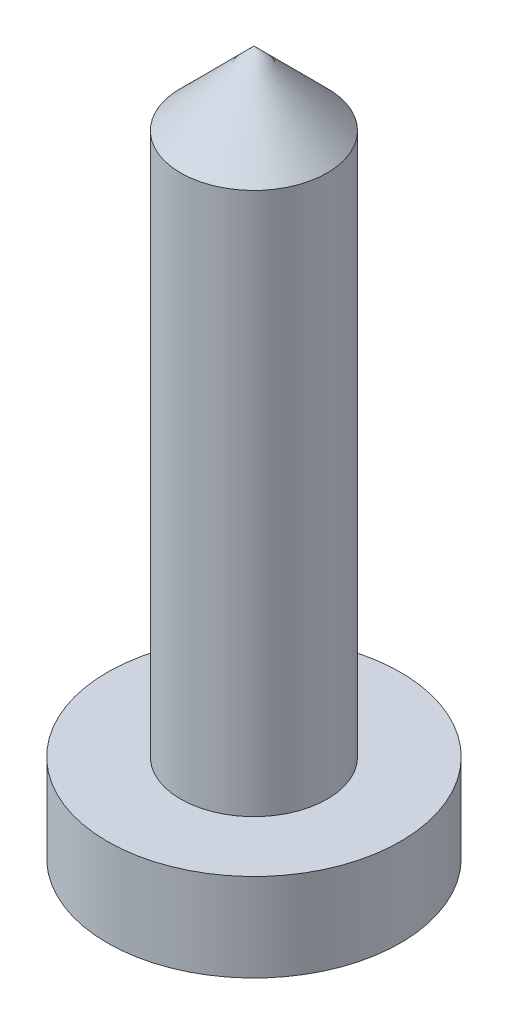
ISO-10303-21;
HEADER;
FILE_DESCRIPTION(('STEP AP214'),'2;1');
FILE_NAME('part.step','',(''),(''),'','','');
FILE_SCHEMA(('AUTOMOTIVE_DESIGN { 1 0 10303 214 1 1 1 1 }'));
ENDSEC;
DATA;
#1=APPLICATION_CONTEXT('core data for automotive mechanical design processes');
#2=APPLICATION_PROTOCOL_DEFINITION('international standard','automotive_design',2000,#1);
#3=PRODUCT_CONTEXT('',#1,'mechanical');
#4=PRODUCT('Part','Part','',(#3));
#5=PRODUCT_RELATED_PRODUCT_CATEGORY('part','',(#4));
#6=PRODUCT_DEFINITION_FORMATION('','',#4);
#7=PRODUCT_DEFINITION_CONTEXT('part definition',#1,'design');
#8=PRODUCT_DEFINITION('design','',#6,#7);
#9=PRODUCT_DEFINITION_SHAPE('','',#8);
#10=(LENGTH_UNIT() NAMED_UNIT(*) SI_UNIT(.MILLI.,.METRE.));
#11=(NAMED_UNIT(*) PLANE_ANGLE_UNIT() SI_UNIT($,.RADIAN.));
#12=(NAMED_UNIT(*) SI_UNIT($,.STERADIAN.) SOLID_ANGLE_UNIT());
#13=UNCERTAINTY_MEASURE_WITH_UNIT(LENGTH_MEASURE(1.E-05),#10,'distance_accuracy_value','');
#14=(GEOMETRIC_REPRESENTATION_CONTEXT(3) GLOBAL_UNCERTAINTY_ASSIGNED_CONTEXT((#13)) GLOBAL_UNIT_ASSIGNED_CONTEXT((#10,
#11,#12)) REPRESENTATION_CONTEXT('',''));
#15=CARTESIAN_POINT('',(0.,0.,0.));
#16=DIRECTION('',(0.,0.,1.));
#17=DIRECTION('',(1.,0.,0.));
#18=AXIS2_PLACEMENT_3D('',#15,#16,#17);
#19=CARTESIAN_POINT('',(0.,3.,0.));
#20=DIRECTION('',(0.,1.,0.));
#21=DIRECTION('',(0.,0.,1.));
#22=AXIS2_PLACEMENT_3D('',#19,#20,#21);
#23=PLANE('',#22);
#24=CARTESIAN_POINT('',(0.,3.,0.));
#25=DIRECTION('',(0.,1.,0.));
#26=DIRECTION('',(0.,0.,1.));
#27=AXIS2_PLACEMENT_3D('',#24,#25,#26);
#28=CIRCLE('',#27,5.);
#29=CARTESIAN_POINT('',(0.,3.,5.));
#30=VERTEX_POINT('',#29);
#31=EDGE_CURVE('E11',#30,#30,#28,.T.);
#32=ORIENTED_EDGE('',*,*,#31,.T.);
#33=EDGE_LOOP('',(#32));
#34=FACE_BOUND('',#33,.T.);
#35=CARTESIAN_POINT('',(0.,3.,0.));
#36=DIRECTION('',(0.,1.,0.));
#37=DIRECTION('',(0.,0.,1.));
#38=AXIS2_PLACEMENT_3D('',#35,#36,#37);
#39=CIRCLE('',#38,2.5);
#40=CARTESIAN_POINT('',(0.,3.,2.5));
#41=VERTEX_POINT('',#40);
#42=EDGE_CURVE('E151',#41,#41,#39,.T.);
#43=ORIENTED_EDGE('',*,*,#42,.F.);
#44=EDGE_LOOP('',(#43));
#45=FACE_BOUND('',#44,.T.);
#46=ADVANCED_FACE('F41',(#34,#45),#23,.T.);
#47=CARTESIAN_POINT('',(0.,0.,0.));
#48=DIRECTION('',(0.,1.,0.));
#49=DIRECTION('',(0.,0.,1.));
#50=AXIS2_PLACEMENT_3D('',#47,#48,#49);
#51=PLANE('',#50);
#52=DIRECTION('',(-0.5,0.,0.866025403784438));
#53=VECTOR('',#52,1.);
#54=CARTESIAN_POINT('',(3.,0.,0.));
#55=LINE('',#54,#53);
#56=CARTESIAN_POINT('',(3.,0.,0.));
#57=VERTEX_POINT('',#56);
#58=CARTESIAN_POINT('',(1.5,0.,2.59807621135332));
#59=VERTEX_POINT('',#58);
#60=EDGE_CURVE('E129',#57,#59,#55,.T.);
#61=ORIENTED_EDGE('',*,*,#60,.F.);
#62=DIRECTION('',(0.5,0.,0.866025403784439));
#63=VECTOR('',#62,1.);
#64=CARTESIAN_POINT('',(1.5,0.,-2.59807621135332));
#65=LINE('',#64,#63);
#66=CARTESIAN_POINT('',(1.5,0.,-2.59807621135332));
#67=VERTEX_POINT('',#66);
#68=EDGE_CURVE('E56',#67,#57,#65,.T.);
#69=ORIENTED_EDGE('',*,*,#68,.F.);
#70=DIRECTION('',(1.,0.,0.));
#71=VECTOR('',#70,1.);
#72=CARTESIAN_POINT('',(-1.5,0.,-2.59807621135332));
#73=LINE('',#72,#71);
#74=CARTESIAN_POINT('',(-1.5,0.,-2.59807621135332));
#75=VERTEX_POINT('',#74);
#76=EDGE_CURVE('E115',#75,#67,#73,.T.);
#77=ORIENTED_EDGE('',*,*,#76,.F.);
#78=DIRECTION('',(0.5,0.,-0.866025403784439));
#79=VECTOR('',#78,1.);
#80=CARTESIAN_POINT('',(-3.,0.,0.));
#81=LINE('',#80,#79);
#82=CARTESIAN_POINT('',(-3.,0.,0.));
#83=VERTEX_POINT('',#82);
#84=EDGE_CURVE('E118',#83,#75,#81,.T.);
#85=ORIENTED_EDGE('',*,*,#84,.F.);
#86=DIRECTION('',(-0.5,0.,-0.866025403784439));
#87=VECTOR('',#86,1.);
#88=CARTESIAN_POINT('',(-1.5,0.,2.59807621135332));
#89=LINE('',#88,#87);
#90=CARTESIAN_POINT('',(-1.5,0.,2.59807621135332));
#91=VERTEX_POINT('',#90);
#92=EDGE_CURVE('E134',#91,#83,#89,.T.);
#93=ORIENTED_EDGE('',*,*,#92,.F.);
#94=DIRECTION('',(-1.,0.,0.));
#95=VECTOR('',#94,1.);
#96=CARTESIAN_POINT('',(1.5,0.,2.59807621135332));
#97=LINE('',#96,#95);
#98=EDGE_CURVE('E131',#59,#91,#97,.T.);
#99=ORIENTED_EDGE('',*,*,#98,.F.);
#100=EDGE_LOOP('',(#61,#69,#77,#85,#93,#99));
#101=FACE_BOUND('',#100,.T.);
#102=CARTESIAN_POINT('',(0.,0.,0.));
#103=DIRECTION('',(0.,1.,0.));
#104=DIRECTION('',(0.,0.,1.));
#105=AXIS2_PLACEMENT_3D('',#102,#103,#104);
#106=CIRCLE('',#105,5.);
#107=CARTESIAN_POINT('',(0.,0.,5.));
#108=VERTEX_POINT('',#107);
#109=EDGE_CURVE('E45',#108,#108,#106,.T.);
#110=ORIENTED_EDGE('',*,*,#109,.F.);
#111=EDGE_LOOP('',(#110));
#112=FACE_BOUND('',#111,.T.);
#113=ADVANCED_FACE('F159',(#101,#112),#51,.F.);
#114=CARTESIAN_POINT('',(0.,3.,0.));
#115=DIRECTION('',(0.,-1.,0.));
#116=DIRECTION('',(0.,0.,-1.));
#117=AXIS2_PLACEMENT_3D('',#114,#115,#116);
#118=CYLINDRICAL_SURFACE('',#117,5.);
#119=ORIENTED_EDGE('',*,*,#31,.F.);
#120=EDGE_LOOP('',(#119));
#121=FACE_BOUND('',#120,.T.);
#122=ORIENTED_EDGE('',*,*,#109,.T.);
#123=EDGE_LOOP('',(#122));
#124=FACE_BOUND('',#123,.T.);
#125=ADVANCED_FACE('F43',(#121,#124),#118,.T.);
#126=CARTESIAN_POINT('',(0.,21.5,0.));
#127=DIRECTION('',(0.,-1.,0.));
#128=DIRECTION('',(0.,0.,-1.));
#129=AXIS2_PLACEMENT_3D('',#126,#127,#128);
#130=CYLINDRICAL_SURFACE('',#129,2.5);
#131=ORIENTED_EDGE('',*,*,#42,.T.);
#132=EDGE_LOOP('',(#131));
#133=FACE_BOUND('',#132,.T.);
#134=CARTESIAN_POINT('',(0.,21.5,0.));
#135=DIRECTION('',(0.,1.,0.));
#136=DIRECTION('',(0.,0.,1.));
#137=AXIS2_PLACEMENT_3D('',#134,#135,#136);
#138=CIRCLE('',#137,2.5);
#139=CARTESIAN_POINT('',(0.,21.5,2.5));
#140=VERTEX_POINT('',#139);
#141=EDGE_CURVE('E141',#140,#140,#138,.T.);
#142=ORIENTED_EDGE('',*,*,#141,.F.);
#143=EDGE_LOOP('',(#142));
#144=FACE_BOUND('',#143,.T.);
#145=ADVANCED_FACE('F166',(#133,#144),#130,.T.);
#146=CARTESIAN_POINT('',(0.,21.5,0.));
#147=DIRECTION('',(0.,-1.,0.));
#148=DIRECTION('',(0.,0.,1.));
#149=AXIS2_PLACEMENT_3D('',#146,#147,#148);
#150=CONICAL_SURFACE('',#149,2.5,0.785398163397449);
#151=CARTESIAN_POINT('',(0.,24.,0.));
#152=VERTEX_POINT('',#151);
#153=VERTEX_LOOP('',#152);
#154=FACE_BOUND('',#153,.T.);
#155=ORIENTED_EDGE('',*,*,#141,.T.);
#156=EDGE_LOOP('',(#155));
#157=FACE_BOUND('',#156,.T.);
#158=ADVANCED_FACE('F173',(#154,#157),#150,.T.);
#159=CARTESIAN_POINT('',(1.5,2.5,-2.59807621135332));
#160=DIRECTION('',(0.866025403784439,0.,-0.5));
#161=DIRECTION('',(-0.5,0.,-0.866025403784439));
#162=AXIS2_PLACEMENT_3D('',#159,#160,#161);
#163=PLANE('',#162);
#164=ORIENTED_EDGE('',*,*,#68,.T.);
#165=DIRECTION('',(0.,-1.,0.));
#166=VECTOR('',#165,1.);
#167=CARTESIAN_POINT('',(3.,2.5,0.));
#168=LINE('',#167,#166);
#169=CARTESIAN_POINT('',(3.,2.5,0.));
#170=VERTEX_POINT('',#169);
#171=EDGE_CURVE('E92',#170,#57,#168,.T.);
#172=ORIENTED_EDGE('',*,*,#171,.F.);
#173=DIRECTION('',(0.5,0.,0.866025403784439));
#174=VECTOR('',#173,1.);
#175=CARTESIAN_POINT('',(1.5,2.5,-2.59807621135332));
#176=LINE('',#175,#174);
#177=CARTESIAN_POINT('',(1.5,2.5,-2.59807621135332));
#178=VERTEX_POINT('',#177);
#179=EDGE_CURVE('E96',#178,#170,#176,.T.);
#180=ORIENTED_EDGE('',*,*,#179,.F.);
#181=DIRECTION('',(0.,-1.,0.));
#182=VECTOR('',#181,1.);
#183=CARTESIAN_POINT('',(1.5,2.5,-2.59807621135332));
#184=LINE('',#183,#182);
#185=EDGE_CURVE('E139',#178,#67,#184,.T.);
#186=ORIENTED_EDGE('',*,*,#185,.T.);
#187=EDGE_LOOP('',(#164,#172,#180,#186));
#188=FACE_BOUND('',#187,.T.);
#189=ADVANCED_FACE('F94',(#188),#163,.F.);
#190=CARTESIAN_POINT('',(-1.5,2.5,-2.59807621135332));
#191=DIRECTION('',(0.,0.,-1.));
#192=DIRECTION('',(-1.,0.,0.));
#193=AXIS2_PLACEMENT_3D('',#190,#191,#192);
#194=PLANE('',#193);
#195=ORIENTED_EDGE('',*,*,#76,.T.);
#196=ORIENTED_EDGE('',*,*,#185,.F.);
#197=DIRECTION('',(1.,0.,0.));
#198=VECTOR('',#197,1.);
#199=CARTESIAN_POINT('',(-1.5,2.5,-2.59807621135332));
#200=LINE('',#199,#198);
#201=CARTESIAN_POINT('',(-1.5,2.5,-2.59807621135332));
#202=VERTEX_POINT('',#201);
#203=EDGE_CURVE('E102',#202,#178,#200,.T.);
#204=ORIENTED_EDGE('',*,*,#203,.F.);
#205=DIRECTION('',(0.,-1.,0.));
#206=VECTOR('',#205,1.);
#207=CARTESIAN_POINT('',(-1.5,2.5,-2.59807621135332));
#208=LINE('',#207,#206);
#209=EDGE_CURVE('E142',#202,#75,#208,.T.);
#210=ORIENTED_EDGE('',*,*,#209,.T.);
#211=EDGE_LOOP('',(#195,#196,#204,#210));
#212=FACE_BOUND('',#211,.T.);
#213=ADVANCED_FACE('F178',(#212),#194,.F.);
#214=CARTESIAN_POINT('',(-3.,2.5,0.));
#215=DIRECTION('',(-0.866025403784439,0.,-0.5));
#216=DIRECTION('',(-0.5,0.,0.866025403784439));
#217=AXIS2_PLACEMENT_3D('',#214,#215,#216);
#218=PLANE('',#217);
#219=ORIENTED_EDGE('',*,*,#84,.T.);
#220=ORIENTED_EDGE('',*,*,#209,.F.);
#221=DIRECTION('',(0.5,0.,-0.866025403784439));
#222=VECTOR('',#221,1.);
#223=CARTESIAN_POINT('',(-3.,2.5,0.));
#224=LINE('',#223,#222);
#225=CARTESIAN_POINT('',(-3.,2.5,0.));
#226=VERTEX_POINT('',#225);
#227=EDGE_CURVE('E125',#226,#202,#224,.T.);
#228=ORIENTED_EDGE('',*,*,#227,.F.);
#229=DIRECTION('',(0.,-1.,0.));
#230=VECTOR('',#229,1.);
#231=CARTESIAN_POINT('',(-3.,2.5,0.));
#232=LINE('',#231,#230);
#233=EDGE_CURVE('E144',#226,#83,#232,.T.);
#234=ORIENTED_EDGE('',*,*,#233,.T.);
#235=EDGE_LOOP('',(#219,#220,#228,#234));
#236=FACE_BOUND('',#235,.T.);
#237=ADVANCED_FACE('F188',(#236),#218,.F.);
#238=CARTESIAN_POINT('',(-1.5,2.5,2.59807621135332));
#239=DIRECTION('',(-0.866025403784439,0.,0.5));
#240=DIRECTION('',(0.5,0.,0.866025403784439));
#241=AXIS2_PLACEMENT_3D('',#238,#239,#240);
#242=PLANE('',#241);
#243=ORIENTED_EDGE('',*,*,#92,.T.);
#244=ORIENTED_EDGE('',*,*,#233,.F.);
#245=DIRECTION('',(-0.5,0.,-0.866025403784439));
#246=VECTOR('',#245,1.);
#247=CARTESIAN_POINT('',(-1.5,2.5,2.59807621135332));
#248=LINE('',#247,#246);
#249=CARTESIAN_POINT('',(-1.5,2.5,2.59807621135332));
#250=VERTEX_POINT('',#249);
#251=EDGE_CURVE('E122',#250,#226,#248,.T.);
#252=ORIENTED_EDGE('',*,*,#251,.F.);
#253=DIRECTION('',(0.,-1.,0.));
#254=VECTOR('',#253,1.);
#255=CARTESIAN_POINT('',(-1.5,2.5,2.59807621135332));
#256=LINE('',#255,#254);
#257=EDGE_CURVE('E146',#250,#91,#256,.T.);
#258=ORIENTED_EDGE('',*,*,#257,.T.);
#259=EDGE_LOOP('',(#243,#244,#252,#258));
#260=FACE_BOUND('',#259,.T.);
#261=ADVANCED_FACE('F184',(#260),#242,.F.);
#262=CARTESIAN_POINT('',(1.5,2.5,2.59807621135332));
#263=DIRECTION('',(0.,0.,1.));
#264=DIRECTION('',(1.,0.,0.));
#265=AXIS2_PLACEMENT_3D('',#262,#263,#264);
#266=PLANE('',#265);
#267=ORIENTED_EDGE('',*,*,#98,.T.);
#268=ORIENTED_EDGE('',*,*,#257,.F.);
#269=DIRECTION('',(-1.,0.,0.));
#270=VECTOR('',#269,1.);
#271=CARTESIAN_POINT('',(1.5,2.5,2.59807621135332));
#272=LINE('',#271,#270);
#273=CARTESIAN_POINT('',(1.5,2.5,2.59807621135332));
#274=VERTEX_POINT('',#273);
#275=EDGE_CURVE('E110',#274,#250,#272,.T.);
#276=ORIENTED_EDGE('',*,*,#275,.F.);
#277=DIRECTION('',(0.,-1.,0.));
#278=VECTOR('',#277,1.);
#279=CARTESIAN_POINT('',(1.5,2.5,2.59807621135332));
#280=LINE('',#279,#278);
#281=EDGE_CURVE('E101',#274,#59,#280,.T.);
#282=ORIENTED_EDGE('',*,*,#281,.T.);
#283=EDGE_LOOP('',(#267,#268,#276,#282));
#284=FACE_BOUND('',#283,.T.);
#285=ADVANCED_FACE('F181',(#284),#266,.F.);
#286=CARTESIAN_POINT('',(3.,2.5,0.));
#287=DIRECTION('',(0.866025403784439,0.,0.5));
#288=DIRECTION('',(0.5,0.,-0.866025403784439));
#289=AXIS2_PLACEMENT_3D('',#286,#287,#288);
#290=PLANE('',#289);
#291=ORIENTED_EDGE('',*,*,#60,.T.);
#292=ORIENTED_EDGE('',*,*,#281,.F.);
#293=DIRECTION('',(-0.5,0.,0.866025403784438));
#294=VECTOR('',#293,1.);
#295=CARTESIAN_POINT('',(3.,2.5,0.));
#296=LINE('',#295,#294);
#297=EDGE_CURVE('E105',#170,#274,#296,.T.);
#298=ORIENTED_EDGE('',*,*,#297,.F.);
#299=ORIENTED_EDGE('',*,*,#171,.T.);
#300=EDGE_LOOP('',(#291,#292,#298,#299));
#301=FACE_BOUND('',#300,.T.);
#302=ADVANCED_FACE('F106',(#301),#290,.F.);
#303=CARTESIAN_POINT('',(0.,2.5,0.));
#304=DIRECTION('',(0.,-1.,0.));
#305=DIRECTION('',(0.,0.,-1.));
#306=AXIS2_PLACEMENT_3D('',#303,#304,#305);
#307=PLANE('',#306);
#308=ORIENTED_EDGE('',*,*,#179,.T.);
#309=ORIENTED_EDGE('',*,*,#297,.T.);
#310=ORIENTED_EDGE('',*,*,#275,.T.);
#311=ORIENTED_EDGE('',*,*,#251,.T.);
#312=ORIENTED_EDGE('',*,*,#227,.T.);
#313=ORIENTED_EDGE('',*,*,#203,.T.);
#314=EDGE_LOOP('',(#308,#309,#310,#311,#312,#313));
#315=FACE_BOUND('',#314,.T.);
#316=ADVANCED_FACE('F112',(#315),#307,.T.);
#317=CLOSED_SHELL('',(#46,#113,#125,#145,#158,#189,#213,#237,#261,#285,#302,#316));
#318=MANIFOLD_SOLID_BREP('B2',#317);
#319=ADVANCED_BREP_SHAPE_REPRESENTATION('',(#18,#318),#14);
#320=SHAPE_DEFINITION_REPRESENTATION(#9,#319);
ENDSEC;
END-ISO-10303-21;
